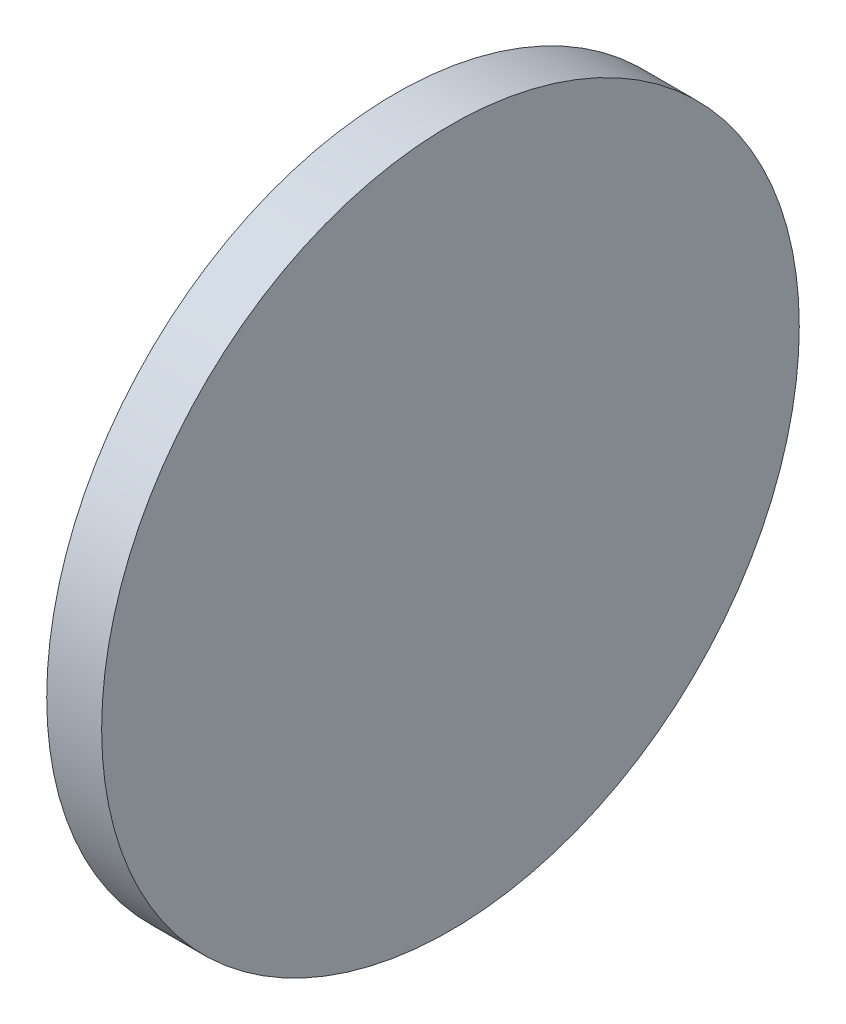
ISO-10303-21;
HEADER;
FILE_DESCRIPTION(('STEP AP214'),'2;1');
FILE_NAME('part.step','',(''),(''),'','','');
FILE_SCHEMA(('AUTOMOTIVE_DESIGN { 1 0 10303 214 1 1 1 1 }'));
ENDSEC;
DATA;
#1=APPLICATION_CONTEXT('core data for automotive mechanical design processes');
#2=APPLICATION_PROTOCOL_DEFINITION('international standard','automotive_design',2000,#1);
#3=PRODUCT_CONTEXT('',#1,'mechanical');
#4=PRODUCT('Part','Part','',(#3));
#5=PRODUCT_RELATED_PRODUCT_CATEGORY('part','',(#4));
#6=PRODUCT_DEFINITION_FORMATION('','',#4);
#7=PRODUCT_DEFINITION_CONTEXT('part definition',#1,'design');
#8=PRODUCT_DEFINITION('design','',#6,#7);
#9=PRODUCT_DEFINITION_SHAPE('','',#8);
#10=(LENGTH_UNIT() NAMED_UNIT(*) SI_UNIT(.MILLI.,.METRE.));
#11=(NAMED_UNIT(*) PLANE_ANGLE_UNIT() SI_UNIT($,.RADIAN.));
#12=(NAMED_UNIT(*) SI_UNIT($,.STERADIAN.) SOLID_ANGLE_UNIT());
#13=UNCERTAINTY_MEASURE_WITH_UNIT(LENGTH_MEASURE(1.E-05),#10,'distance_accuracy_value','');
#14=(GEOMETRIC_REPRESENTATION_CONTEXT(3) GLOBAL_UNCERTAINTY_ASSIGNED_CONTEXT((#13)) GLOBAL_UNIT_ASSIGNED_CONTEXT((#10,
#11,#12)) REPRESENTATION_CONTEXT('',''));
#15=CARTESIAN_POINT('',(0.,0.,0.));
#16=DIRECTION('',(0.,0.,1.));
#17=DIRECTION('',(1.,0.,0.));
#18=AXIS2_PLACEMENT_3D('',#15,#16,#17);
#19=CARTESIAN_POINT('',(0.,0.,0.));
#20=DIRECTION('',(-1.,0.,0.));
#21=DIRECTION('',(0.,0.,1.));
#22=AXIS2_PLACEMENT_3D('',#19,#20,#21);
#23=CYLINDRICAL_SURFACE('',#22,12.7);
#24=CARTESIAN_POINT('',(0.,0.,0.));
#25=DIRECTION('',(-1.,0.,0.));
#26=DIRECTION('',(0.,0.,1.));
#27=AXIS2_PLACEMENT_3D('',#24,#25,#26);
#28=CIRCLE('',#27,12.7);
#29=CARTESIAN_POINT('',(0.,0.,12.7));
#30=VERTEX_POINT('',#29);
#31=EDGE_CURVE('E44',#30,#30,#28,.T.);
#32=ORIENTED_EDGE('',*,*,#31,.F.);
#33=EDGE_LOOP('',(#32));
#34=FACE_BOUND('',#33,.T.);
#35=CARTESIAN_POINT('',(2.,0.,0.));
#36=DIRECTION('',(-1.,0.,0.));
#37=DIRECTION('',(0.,0.,1.));
#38=AXIS2_PLACEMENT_3D('',#35,#36,#37);
#39=CIRCLE('',#38,12.7);
#40=CARTESIAN_POINT('',(2.,0.,12.7));
#41=VERTEX_POINT('',#40);
#42=EDGE_CURVE('E10',#41,#41,#39,.T.);
#43=ORIENTED_EDGE('',*,*,#42,.T.);
#44=EDGE_LOOP('',(#43));
#45=FACE_BOUND('',#44,.T.);
#46=ADVANCED_FACE('F37',(#34,#45),#23,.T.);
#47=CARTESIAN_POINT('',(2.,12.7,0.));
#48=DIRECTION('',(-1.,0.,0.));
#49=DIRECTION('',(0.,0.,1.));
#50=AXIS2_PLACEMENT_3D('',#47,#48,#49);
#51=PLANE('',#50);
#52=ORIENTED_EDGE('',*,*,#42,.F.);
#53=EDGE_LOOP('',(#52));
#54=FACE_BOUND('',#53,.T.);
#55=ADVANCED_FACE('F54',(#54),#51,.F.);
#56=CARTESIAN_POINT('',(0.,12.7,0.));
#57=DIRECTION('',(1.,0.,0.));
#58=DIRECTION('',(0.,0.,-1.));
#59=AXIS2_PLACEMENT_3D('',#56,#57,#58);
#60=PLANE('',#59);
#61=ORIENTED_EDGE('',*,*,#31,.T.);
#62=EDGE_LOOP('',(#61));
#63=FACE_BOUND('',#62,.T.);
#64=ADVANCED_FACE('F51',(#63),#60,.F.);
#65=CLOSED_SHELL('',(#46,#55,#64));
#66=MANIFOLD_SOLID_BREP('B2',#65);
#67=ADVANCED_BREP_SHAPE_REPRESENTATION('',(#18,#66),#14);
#68=SHAPE_DEFINITION_REPRESENTATION(#9,#67);
ENDSEC;
END-ISO-10303-21;
